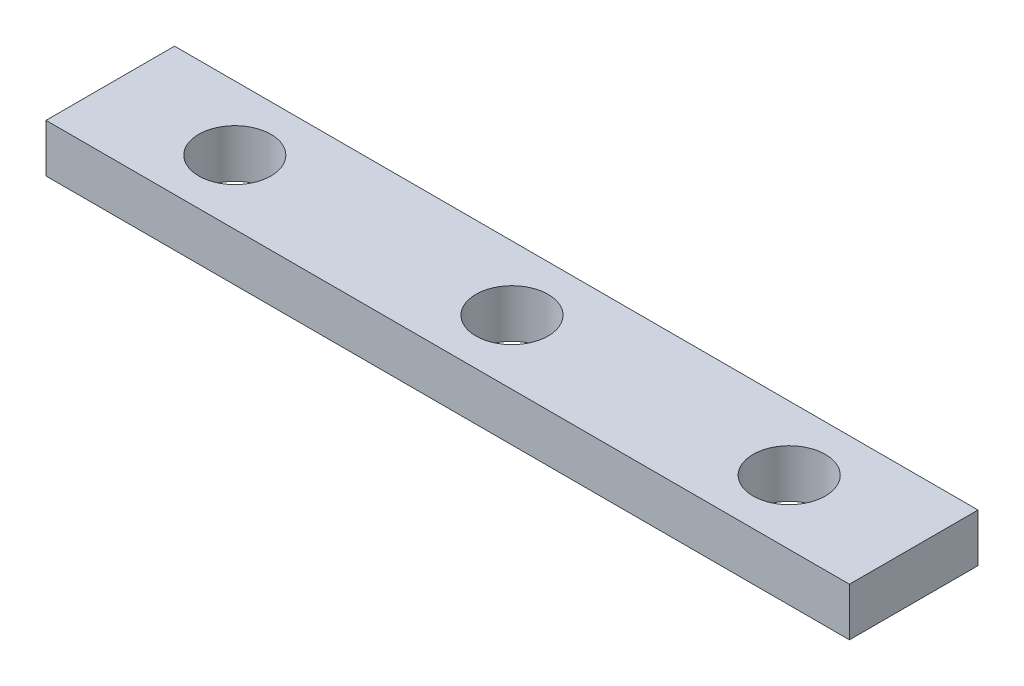
ISO-10303-21;
HEADER;
FILE_DESCRIPTION(('STEP AP214'),'2;1');
FILE_NAME('part.step','',(''),(''),'','','');
FILE_SCHEMA(('AUTOMOTIVE_DESIGN { 1 0 10303 214 1 1 1 1 }'));
ENDSEC;
DATA;
#1=APPLICATION_CONTEXT('core data for automotive mechanical design processes');
#2=APPLICATION_PROTOCOL_DEFINITION('international standard','automotive_design',2000,#1);
#3=PRODUCT_CONTEXT('',#1,'mechanical');
#4=PRODUCT('Part','Part','',(#3));
#5=PRODUCT_RELATED_PRODUCT_CATEGORY('part','',(#4));
#6=PRODUCT_DEFINITION_FORMATION('','',#4);
#7=PRODUCT_DEFINITION_CONTEXT('part definition',#1,'design');
#8=PRODUCT_DEFINITION('design','',#6,#7);
#9=PRODUCT_DEFINITION_SHAPE('','',#8);
#10=(LENGTH_UNIT() NAMED_UNIT(*) SI_UNIT(.MILLI.,.METRE.));
#11=(NAMED_UNIT(*) PLANE_ANGLE_UNIT() SI_UNIT($,.RADIAN.));
#12=(NAMED_UNIT(*) SI_UNIT($,.STERADIAN.) SOLID_ANGLE_UNIT());
#13=UNCERTAINTY_MEASURE_WITH_UNIT(LENGTH_MEASURE(1.E-05),#10,'distance_accuracy_value','');
#14=(GEOMETRIC_REPRESENTATION_CONTEXT(3) GLOBAL_UNCERTAINTY_ASSIGNED_CONTEXT((#13)) GLOBAL_UNIT_ASSIGNED_CONTEXT((#10,
#11,#12)) REPRESENTATION_CONTEXT('',''));
#15=CARTESIAN_POINT('',(0.,0.,0.));
#16=DIRECTION('',(0.,0.,1.));
#17=DIRECTION('',(1.,0.,0.));
#18=AXIS2_PLACEMENT_3D('',#15,#16,#17);
#19=CARTESIAN_POINT('',(-7.22636700217678,3.,-4.3135593220339));
#20=DIRECTION('',(1.,0.,0.));
#21=DIRECTION('',(0.,0.,-1.));
#22=AXIS2_PLACEMENT_3D('',#19,#20,#21);
#23=PLANE('',#22);
#24=DIRECTION('',(0.,0.,1.));
#25=VECTOR('',#24,1.);
#26=CARTESIAN_POINT('',(-7.22636700217678,0.,-4.3135593220339));
#27=LINE('',#26,#25);
#28=CARTESIAN_POINT('',(-7.22636700217678,0.,-4.3135593220339));
#29=VERTEX_POINT('',#28);
#30=CARTESIAN_POINT('',(-7.22636700217678,0.,3.6864406779661));
#31=VERTEX_POINT('',#30);
#32=EDGE_CURVE('E98',#29,#31,#27,.T.);
#33=ORIENTED_EDGE('',*,*,#32,.T.);
#34=DIRECTION('',(0.,-1.,0.));
#35=VECTOR('',#34,1.);
#36=CARTESIAN_POINT('',(-7.22636700217678,3.,3.6864406779661));
#37=LINE('',#36,#35);
#38=CARTESIAN_POINT('',(-7.22636700217678,3.,3.6864406779661));
#39=VERTEX_POINT('',#38);
#40=EDGE_CURVE('E11',#39,#31,#37,.T.);
#41=ORIENTED_EDGE('',*,*,#40,.F.);
#42=DIRECTION('',(0.,0.,1.));
#43=VECTOR('',#42,1.);
#44=CARTESIAN_POINT('',(-7.22636700217678,3.,-4.3135593220339));
#45=LINE('',#44,#43);
#46=CARTESIAN_POINT('',(-7.22636700217678,3.,-4.3135593220339));
#47=VERTEX_POINT('',#46);
#48=EDGE_CURVE('E85',#47,#39,#45,.T.);
#49=ORIENTED_EDGE('',*,*,#48,.F.);
#50=DIRECTION('',(0.,-1.,0.));
#51=VECTOR('',#50,1.);
#52=CARTESIAN_POINT('',(-7.22636700217678,3.,-4.3135593220339));
#53=LINE('',#52,#51);
#54=EDGE_CURVE('E94',#47,#29,#53,.T.);
#55=ORIENTED_EDGE('',*,*,#54,.T.);
#56=EDGE_LOOP('',(#33,#41,#49,#55));
#57=FACE_BOUND('',#56,.T.);
#58=ADVANCED_FACE('F32',(#57),#23,.F.);
#59=CARTESIAN_POINT('',(-7.22636700217678,3.,3.6864406779661));
#60=DIRECTION('',(0.,0.,-1.));
#61=DIRECTION('',(-1.,0.,0.));
#62=AXIS2_PLACEMENT_3D('',#59,#60,#61);
#63=PLANE('',#62);
#64=DIRECTION('',(1.,0.,0.));
#65=VECTOR('',#64,1.);
#66=CARTESIAN_POINT('',(-7.22636700217678,0.,3.6864406779661));
#67=LINE('',#66,#65);
#68=CARTESIAN_POINT('',(42.7736329978232,0.,3.6864406779661));
#69=VERTEX_POINT('',#68);
#70=EDGE_CURVE('E89',#31,#69,#67,.T.);
#71=ORIENTED_EDGE('',*,*,#70,.T.);
#72=DIRECTION('',(0.,-1.,0.));
#73=VECTOR('',#72,1.);
#74=CARTESIAN_POINT('',(42.7736329978232,3.,3.6864406779661));
#75=LINE('',#74,#73);
#76=CARTESIAN_POINT('',(42.7736329978232,3.,3.6864406779661));
#77=VERTEX_POINT('',#76);
#78=EDGE_CURVE('E41',#77,#69,#75,.T.);
#79=ORIENTED_EDGE('',*,*,#78,.F.);
#80=DIRECTION('',(1.,0.,0.));
#81=VECTOR('',#80,1.);
#82=CARTESIAN_POINT('',(-7.22636700217678,3.,3.6864406779661));
#83=LINE('',#82,#81);
#84=EDGE_CURVE('E80',#39,#77,#83,.T.);
#85=ORIENTED_EDGE('',*,*,#84,.F.);
#86=ORIENTED_EDGE('',*,*,#40,.T.);
#87=EDGE_LOOP('',(#71,#79,#85,#86));
#88=FACE_BOUND('',#87,.T.);
#89=ADVANCED_FACE('F88',(#88),#63,.F.);
#90=CARTESIAN_POINT('',(42.7736329978232,3.,-4.3135593220339));
#91=DIRECTION('',(-1.,0.,0.));
#92=DIRECTION('',(0.,0.,1.));
#93=AXIS2_PLACEMENT_3D('',#90,#91,#92);
#94=PLANE('',#93);
#95=DIRECTION('',(0.,0.,-1.));
#96=VECTOR('',#95,1.);
#97=CARTESIAN_POINT('',(42.7736329978232,0.,-4.3135593220339));
#98=LINE('',#97,#96);
#99=CARTESIAN_POINT('',(42.7736329978232,0.,-4.3135593220339));
#100=VERTEX_POINT('',#99);
#101=EDGE_CURVE('E67',#69,#100,#98,.T.);
#102=ORIENTED_EDGE('',*,*,#101,.T.);
#103=DIRECTION('',(0.,-1.,0.));
#104=VECTOR('',#103,1.);
#105=CARTESIAN_POINT('',(42.7736329978232,3.,-4.3135593220339));
#106=LINE('',#105,#104);
#107=CARTESIAN_POINT('',(42.7736329978232,3.,-4.3135593220339));
#108=VERTEX_POINT('',#107);
#109=EDGE_CURVE('E90',#108,#100,#106,.T.);
#110=ORIENTED_EDGE('',*,*,#109,.F.);
#111=DIRECTION('',(0.,0.,-1.));
#112=VECTOR('',#111,1.);
#113=CARTESIAN_POINT('',(42.7736329978232,3.,-4.3135593220339));
#114=LINE('',#113,#112);
#115=EDGE_CURVE('E83',#77,#108,#114,.T.);
#116=ORIENTED_EDGE('',*,*,#115,.F.);
#117=ORIENTED_EDGE('',*,*,#78,.T.);
#118=EDGE_LOOP('',(#102,#110,#116,#117));
#119=FACE_BOUND('',#118,.T.);
#120=ADVANCED_FACE('F92',(#119),#94,.F.);
#121=CARTESIAN_POINT('',(-7.22636700217678,3.,-4.3135593220339));
#122=DIRECTION('',(0.,0.,1.));
#123=DIRECTION('',(1.,0.,0.));
#124=AXIS2_PLACEMENT_3D('',#121,#122,#123);
#125=PLANE('',#124);
#126=DIRECTION('',(-1.,0.,0.));
#127=VECTOR('',#126,1.);
#128=CARTESIAN_POINT('',(-7.22636700217678,0.,-4.3135593220339));
#129=LINE('',#128,#127);
#130=EDGE_CURVE('E73',#100,#29,#129,.T.);
#131=ORIENTED_EDGE('',*,*,#130,.T.);
#132=ORIENTED_EDGE('',*,*,#54,.F.);
#133=DIRECTION('',(-1.,0.,0.));
#134=VECTOR('',#133,1.);
#135=CARTESIAN_POINT('',(-7.22636700217678,3.,-4.3135593220339));
#136=LINE('',#135,#134);
#137=EDGE_CURVE('E50',#108,#47,#136,.T.);
#138=ORIENTED_EDGE('',*,*,#137,.F.);
#139=ORIENTED_EDGE('',*,*,#109,.T.);
#140=EDGE_LOOP('',(#131,#132,#138,#139));
#141=FACE_BOUND('',#140,.T.);
#142=ADVANCED_FACE('F148',(#141),#125,.F.);
#143=CARTESIAN_POINT('',(0.,3.,0.));
#144=DIRECTION('',(0.,1.,0.));
#145=DIRECTION('',(0.,0.,1.));
#146=AXIS2_PLACEMENT_3D('',#143,#144,#145);
#147=PLANE('',#146);
#148=CARTESIAN_POINT('',(0.523632997823222,3.,-0.313559322033901));
#149=DIRECTION('',(0.,1.,0.));
#150=DIRECTION('',(0.,0.,1.));
#151=AXIS2_PLACEMENT_3D('',#148,#149,#150);
#152=CIRCLE('',#151,2.2479);
#153=CARTESIAN_POINT('',(0.523632997823222,3.,1.9343406779661));
#154=VERTEX_POINT('',#153);
#155=EDGE_CURVE('E119',#154,#154,#152,.T.);
#156=ORIENTED_EDGE('',*,*,#155,.F.);
#157=EDGE_LOOP('',(#156));
#158=FACE_BOUND('',#157,.T.);
#159=CARTESIAN_POINT('',(35.0236329978232,3.,-0.313559322033901));
#160=DIRECTION('',(0.,1.,0.));
#161=DIRECTION('',(0.,0.,1.));
#162=AXIS2_PLACEMENT_3D('',#159,#160,#161);
#163=CIRCLE('',#162,2.2479);
#164=CARTESIAN_POINT('',(35.0236329978232,3.,1.9343406779661));
#165=VERTEX_POINT('',#164);
#166=EDGE_CURVE('E109',#165,#165,#163,.T.);
#167=ORIENTED_EDGE('',*,*,#166,.F.);
#168=EDGE_LOOP('',(#167));
#169=FACE_BOUND('',#168,.T.);
#170=CARTESIAN_POINT('',(17.7736329978232,3.,-0.313559322033901));
#171=DIRECTION('',(0.,1.,0.));
#172=DIRECTION('',(0.,0.,1.));
#173=AXIS2_PLACEMENT_3D('',#170,#171,#172);
#174=CIRCLE('',#173,2.2479);
#175=CARTESIAN_POINT('',(17.7736329978232,3.,1.9343406779661));
#176=VERTEX_POINT('',#175);
#177=EDGE_CURVE('E108',#176,#176,#174,.T.);
#178=ORIENTED_EDGE('',*,*,#177,.F.);
#179=EDGE_LOOP('',(#178));
#180=FACE_BOUND('',#179,.T.);
#181=ORIENTED_EDGE('',*,*,#48,.T.);
#182=ORIENTED_EDGE('',*,*,#84,.T.);
#183=ORIENTED_EDGE('',*,*,#115,.T.);
#184=ORIENTED_EDGE('',*,*,#137,.T.);
#185=EDGE_LOOP('',(#181,#182,#183,#184));
#186=FACE_BOUND('',#185,.T.);
#187=ADVANCED_FACE('F81',(#158,#169,#180,#186),#147,.T.);
#188=CARTESIAN_POINT('',(0.,0.,0.));
#189=DIRECTION('',(0.,1.,0.));
#190=DIRECTION('',(0.,0.,1.));
#191=AXIS2_PLACEMENT_3D('',#188,#189,#190);
#192=PLANE('',#191);
#193=CARTESIAN_POINT('',(0.523632997823222,0.,-0.313559322033901));
#194=DIRECTION('',(0.,1.,0.));
#195=DIRECTION('',(0.,0.,1.));
#196=AXIS2_PLACEMENT_3D('',#193,#194,#195);
#197=CIRCLE('',#196,2.2479);
#198=CARTESIAN_POINT('',(0.523632997823222,0.,1.9343406779661));
#199=VERTEX_POINT('',#198);
#200=EDGE_CURVE('E35',#199,#199,#197,.T.);
#201=ORIENTED_EDGE('',*,*,#200,.T.);
#202=EDGE_LOOP('',(#201));
#203=FACE_BOUND('',#202,.T.);
#204=CARTESIAN_POINT('',(35.0236329978232,0.,-0.313559322033901));
#205=DIRECTION('',(0.,1.,0.));
#206=DIRECTION('',(0.,0.,1.));
#207=AXIS2_PLACEMENT_3D('',#204,#205,#206);
#208=CIRCLE('',#207,2.2479);
#209=CARTESIAN_POINT('',(35.0236329978232,0.,1.9343406779661));
#210=VERTEX_POINT('',#209);
#211=EDGE_CURVE('E106',#210,#210,#208,.T.);
#212=ORIENTED_EDGE('',*,*,#211,.T.);
#213=EDGE_LOOP('',(#212));
#214=FACE_BOUND('',#213,.T.);
#215=CARTESIAN_POINT('',(17.7736329978232,0.,-0.313559322033901));
#216=DIRECTION('',(0.,1.,0.));
#217=DIRECTION('',(0.,0.,1.));
#218=AXIS2_PLACEMENT_3D('',#215,#216,#217);
#219=CIRCLE('',#218,2.2479);
#220=CARTESIAN_POINT('',(17.7736329978232,0.,1.9343406779661));
#221=VERTEX_POINT('',#220);
#222=EDGE_CURVE('E101',#221,#221,#219,.T.);
#223=ORIENTED_EDGE('',*,*,#222,.T.);
#224=EDGE_LOOP('',(#223));
#225=FACE_BOUND('',#224,.T.);
#226=ORIENTED_EDGE('',*,*,#32,.F.);
#227=ORIENTED_EDGE('',*,*,#130,.F.);
#228=ORIENTED_EDGE('',*,*,#101,.F.);
#229=ORIENTED_EDGE('',*,*,#70,.F.);
#230=EDGE_LOOP('',(#226,#227,#228,#229));
#231=FACE_BOUND('',#230,.T.);
#232=ADVANCED_FACE('F125',(#203,#214,#225,#231),#192,.F.);
#233=CARTESIAN_POINT('',(17.7736329978232,3.,-0.313559322033901));
#234=DIRECTION('',(0.,1.,0.));
#235=DIRECTION('',(0.,0.,1.));
#236=AXIS2_PLACEMENT_3D('',#233,#234,#235);
#237=CYLINDRICAL_SURFACE('',#236,2.2479);
#238=ORIENTED_EDGE('',*,*,#177,.T.);
#239=EDGE_LOOP('',(#238));
#240=FACE_BOUND('',#239,.T.);
#241=ORIENTED_EDGE('',*,*,#222,.F.);
#242=EDGE_LOOP('',(#241));
#243=FACE_BOUND('',#242,.T.);
#244=ADVANCED_FACE('F128',(#240,#243),#237,.F.);
#245=CARTESIAN_POINT('',(35.0236329978232,3.,-0.313559322033901));
#246=DIRECTION('',(0.,1.,0.));
#247=DIRECTION('',(0.,0.,1.));
#248=AXIS2_PLACEMENT_3D('',#245,#246,#247);
#249=CYLINDRICAL_SURFACE('',#248,2.2479);
#250=ORIENTED_EDGE('',*,*,#166,.T.);
#251=EDGE_LOOP('',(#250));
#252=FACE_BOUND('',#251,.T.);
#253=ORIENTED_EDGE('',*,*,#211,.F.);
#254=EDGE_LOOP('',(#253));
#255=FACE_BOUND('',#254,.T.);
#256=ADVANCED_FACE('F130',(#252,#255),#249,.F.);
#257=CARTESIAN_POINT('',(0.523632997823222,3.,-0.313559322033901));
#258=DIRECTION('',(0.,1.,0.));
#259=DIRECTION('',(0.,0.,1.));
#260=AXIS2_PLACEMENT_3D('',#257,#258,#259);
#261=CYLINDRICAL_SURFACE('',#260,2.2479);
#262=ORIENTED_EDGE('',*,*,#155,.T.);
#263=EDGE_LOOP('',(#262));
#264=FACE_BOUND('',#263,.T.);
#265=ORIENTED_EDGE('',*,*,#200,.F.);
#266=EDGE_LOOP('',(#265));
#267=FACE_BOUND('',#266,.T.);
#268=ADVANCED_FACE('F137',(#264,#267),#261,.F.);
#269=CLOSED_SHELL('',(#58,#89,#120,#142,#187,#232,#244,#256,#268));
#270=MANIFOLD_SOLID_BREP('B2',#269);
#271=ADVANCED_BREP_SHAPE_REPRESENTATION('',(#18,#270),#14);
#272=SHAPE_DEFINITION_REPRESENTATION(#9,#271);
ENDSEC;
END-ISO-10303-21;
